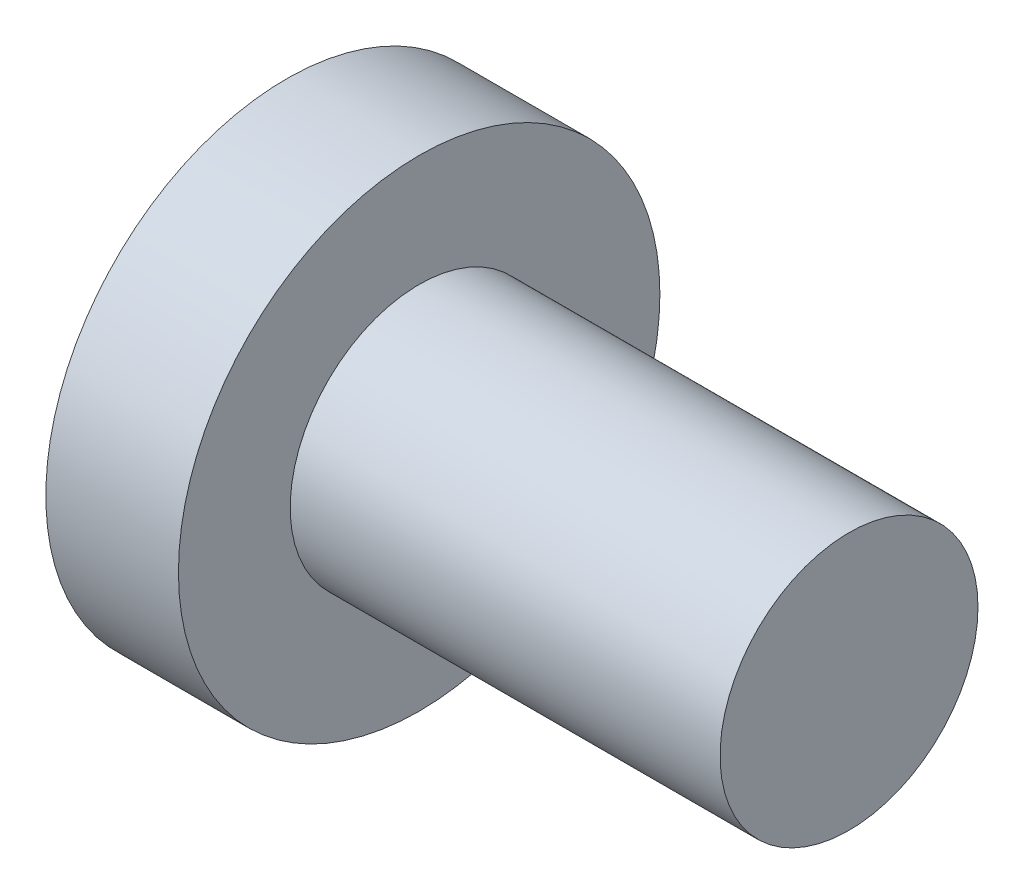
ISO-10303-21;
HEADER;
FILE_DESCRIPTION(('STEP AP214'),'2;1');
FILE_NAME('part.step','',(''),(''),'','','');
FILE_SCHEMA(('AUTOMOTIVE_DESIGN { 1 0 10303 214 1 1 1 1 }'));
ENDSEC;
DATA;
#1=APPLICATION_CONTEXT('core data for automotive mechanical design processes');
#2=APPLICATION_PROTOCOL_DEFINITION('international standard','automotive_design',2000,#1);
#3=PRODUCT_CONTEXT('',#1,'mechanical');
#4=PRODUCT('Part','Part','',(#3));
#5=PRODUCT_RELATED_PRODUCT_CATEGORY('part','',(#4));
#6=PRODUCT_DEFINITION_FORMATION('','',#4);
#7=PRODUCT_DEFINITION_CONTEXT('part definition',#1,'design');
#8=PRODUCT_DEFINITION('design','',#6,#7);
#9=PRODUCT_DEFINITION_SHAPE('','',#8);
#10=(LENGTH_UNIT() NAMED_UNIT(*) SI_UNIT(.MILLI.,.METRE.));
#11=(NAMED_UNIT(*) PLANE_ANGLE_UNIT() SI_UNIT($,.RADIAN.));
#12=(NAMED_UNIT(*) SI_UNIT($,.STERADIAN.) SOLID_ANGLE_UNIT());
#13=UNCERTAINTY_MEASURE_WITH_UNIT(LENGTH_MEASURE(1.E-05),#10,'distance_accuracy_value','');
#14=(GEOMETRIC_REPRESENTATION_CONTEXT(3) GLOBAL_UNCERTAINTY_ASSIGNED_CONTEXT((#13)) GLOBAL_UNIT_ASSIGNED_CONTEXT((#10,
#11,#12)) REPRESENTATION_CONTEXT('',''));
#15=CARTESIAN_POINT('',(0.,0.,0.));
#16=DIRECTION('',(0.,0.,1.));
#17=DIRECTION('',(1.,0.,0.));
#18=AXIS2_PLACEMENT_3D('',#15,#16,#17);
#19=CARTESIAN_POINT('',(5.,0.,0.));
#20=DIRECTION('',(1.,0.,0.));
#21=DIRECTION('',(0.,1.,0.));
#22=AXIS2_PLACEMENT_3D('',#19,#20,#21);
#23=SPHERICAL_SURFACE('',#22,5.);
#24=CARTESIAN_POINT('',(0.857536964558404,0.,0.));
#25=DIRECTION('',(1.,0.,0.));
#26=DIRECTION('',(0.,0.,-1.));
#27=AXIS2_PLACEMENT_3D('',#24,#25,#26);
#28=CIRCLE('',#27,2.8);
#29=CARTESIAN_POINT('',(0.857536964558404,0.,-2.8));
#30=VERTEX_POINT('',#29);
#31=EDGE_CURVE('E341',#30,#30,#28,.T.);
#32=ORIENTED_EDGE('',*,*,#31,.F.);
#33=EDGE_LOOP('',(#32));
#34=FACE_BOUND('',#33,.T.);
#35=CARTESIAN_POINT('',(5.,0.3,0.));
#36=DIRECTION('',(0.,-1.,0.));
#37=DIRECTION('',(0.,0.,-1.));
#38=AXIS2_PLACEMENT_3D('',#35,#36,#37);
#39=CIRCLE('',#38,4.99099188538711);
#40=CARTESIAN_POINT('',(0.204192141108152,0.3,-1.3821096123648));
#41=VERTEX_POINT('',#40);
#42=CARTESIAN_POINT('',(0.0467879563046877,0.3,-0.612935926660946));
#43=VERTEX_POINT('',#42);
#44=EDGE_CURVE('E400',#41,#43,#39,.F.);
#45=ORIENTED_EDGE('',*,*,#44,.T.);
#46=CARTESIAN_POINT('',(4.93762590329132,0.196907273785474,0.341053402576316));
#47=DIRECTION('',(0.156434465040231,-0.493844170297568,-0.855363193977087));
#48=DIRECTION('',(0.,0.866025403784439,-0.5));
#49=AXIS2_PLACEMENT_3D('',#46,#47,#48);
#50=CIRCLE('',#49,4.9840766019576);
#51=CARTESIAN_POINT('',(0.194493269927356,0.976500145219274,-0.976500145219275));
#52=VERTEX_POINT('',#51);
#53=EDGE_CURVE('E294',#43,#52,#50,.T.);
#54=ORIENTED_EDGE('',*,*,#53,.T.);
#55=CARTESIAN_POINT('',(4.93762590329132,-0.341053402576316,-0.196907273785474));
#56=DIRECTION('',(0.156434465040231,0.855363193977087,0.493844170297568));
#57=DIRECTION('',(0.,-0.5,0.866025403784439));
#58=AXIS2_PLACEMENT_3D('',#55,#56,#57);
#59=CIRCLE('',#58,4.9840766019576);
#60=CARTESIAN_POINT('',(0.0467879563046877,0.612935926660946,-0.3));
#61=VERTEX_POINT('',#60);
#62=EDGE_CURVE('E285',#52,#61,#59,.T.);
#63=ORIENTED_EDGE('',*,*,#62,.T.);
#64=CARTESIAN_POINT('',(5.,0.,-0.3));
#65=DIRECTION('',(0.,0.,1.));
#66=DIRECTION('',(1.,0.,0.));
#67=AXIS2_PLACEMENT_3D('',#64,#65,#66);
#68=CIRCLE('',#67,4.99099188538711);
#69=CARTESIAN_POINT('',(0.204192141108152,1.3821096123648,-0.3));
#70=VERTEX_POINT('',#69);
#71=EDGE_CURVE('E398',#61,#70,#68,.F.);
#72=ORIENTED_EDGE('',*,*,#71,.T.);
#73=CARTESIAN_POINT('',(4.39951905283833,-1.0400635094611,0.));
#74=DIRECTION('',(-0.500000000000001,-0.866025403784438,0.));
#75=DIRECTION('',(0.866025403784438,-0.500000000000001,0.));
#76=AXIS2_PLACEMENT_3D('',#73,#74,#75);
#77=CIRCLE('',#76,4.8536265336739);
#78=CARTESIAN_POINT('',(0.204192141108152,1.3821096123648,0.3));
#79=VERTEX_POINT('',#78);
#80=EDGE_CURVE('E401',#70,#79,#77,.F.);
#81=ORIENTED_EDGE('',*,*,#80,.T.);
#82=CARTESIAN_POINT('',(5.,0.,0.3));
#83=DIRECTION('',(0.,0.,-1.));
#84=DIRECTION('',(0.,1.,0.));
#85=AXIS2_PLACEMENT_3D('',#82,#83,#84);
#86=CIRCLE('',#85,4.99099188538711);
#87=CARTESIAN_POINT('',(0.0467879563046877,0.612935926660946,0.3));
#88=VERTEX_POINT('',#87);
#89=EDGE_CURVE('E355',#79,#88,#86,.F.);
#90=ORIENTED_EDGE('',*,*,#89,.T.);
#91=CARTESIAN_POINT('',(4.93762590329132,-0.341053402576316,0.196907273785474));
#92=DIRECTION('',(0.156434465040231,0.855363193977087,-0.493844170297568));
#93=DIRECTION('',(0.,0.5,0.866025403784439));
#94=AXIS2_PLACEMENT_3D('',#91,#92,#93);
#95=CIRCLE('',#94,4.9840766019576);
#96=CARTESIAN_POINT('',(0.194493269927356,0.976500145219275,0.976500145219275));
#97=VERTEX_POINT('',#96);
#98=EDGE_CURVE('E308',#88,#97,#95,.T.);
#99=ORIENTED_EDGE('',*,*,#98,.T.);
#100=CARTESIAN_POINT('',(4.93762590329132,0.196907273785474,-0.341053402576316));
#101=DIRECTION('',(0.156434465040231,-0.493844170297568,0.855363193977087));
#102=DIRECTION('',(0.,-0.866025403784439,-0.5));
#103=AXIS2_PLACEMENT_3D('',#100,#101,#102);
#104=CIRCLE('',#103,4.9840766019576);
#105=CARTESIAN_POINT('',(0.0467879563046886,0.3,0.612935926660946));
#106=VERTEX_POINT('',#105);
#107=EDGE_CURVE('E301',#97,#106,#104,.T.);
#108=ORIENTED_EDGE('',*,*,#107,.T.);
#109=CARTESIAN_POINT('',(5.,0.3,0.));
#110=DIRECTION('',(0.,-1.,0.));
#111=DIRECTION('',(0.,0.,-1.));
#112=AXIS2_PLACEMENT_3D('',#109,#110,#111);
#113=CIRCLE('',#112,4.99099188538711);
#114=CARTESIAN_POINT('',(0.204192141108151,0.3,1.3821096123648));
#115=VERTEX_POINT('',#114);
#116=EDGE_CURVE('E360',#106,#115,#113,.F.);
#117=ORIENTED_EDGE('',*,*,#116,.T.);
#118=CARTESIAN_POINT('',(4.39951905283832,0.,-1.0400635094611));
#119=DIRECTION('',(-0.500000000000001,0.,-0.866025403784438));
#120=DIRECTION('',(-0.866025403784438,0.,0.500000000000001));
#121=AXIS2_PLACEMENT_3D('',#118,#119,#120);
#122=CIRCLE('',#121,4.8536265336739);
#123=CARTESIAN_POINT('',(0.204192141108151,-0.3,1.3821096123648));
#124=VERTEX_POINT('',#123);
#125=EDGE_CURVE('E405',#115,#124,#122,.F.);
#126=ORIENTED_EDGE('',*,*,#125,.T.);
#127=CARTESIAN_POINT('',(5.,-0.3,0.));
#128=DIRECTION('',(0.,1.,0.));
#129=DIRECTION('',(0.,0.,1.));
#130=AXIS2_PLACEMENT_3D('',#127,#128,#129);
#131=CIRCLE('',#130,4.99099188538711);
#132=CARTESIAN_POINT('',(0.0467879563046877,-0.3,0.612935926660946));
#133=VERTEX_POINT('',#132);
#134=EDGE_CURVE('E392',#124,#133,#131,.F.);
#135=ORIENTED_EDGE('',*,*,#134,.T.);
#136=CARTESIAN_POINT('',(4.93762590329132,-0.196907273785474,-0.341053402576316));
#137=DIRECTION('',(0.156434465040231,0.493844170297568,0.855363193977087));
#138=DIRECTION('',(0.,-0.866025403784439,0.5));
#139=AXIS2_PLACEMENT_3D('',#136,#137,#138);
#140=CIRCLE('',#139,4.9840766019576);
#141=CARTESIAN_POINT('',(0.194493269927357,-0.976500145219275,0.976500145219275));
#142=VERTEX_POINT('',#141);
#143=EDGE_CURVE('E336',#133,#142,#140,.T.);
#144=ORIENTED_EDGE('',*,*,#143,.T.);
#145=CARTESIAN_POINT('',(4.93762590329132,0.341053402576316,0.196907273785474));
#146=DIRECTION('',(0.156434465040231,-0.855363193977086,-0.493844170297568));
#147=DIRECTION('',(0.,0.5,-0.866025403784439));
#148=AXIS2_PLACEMENT_3D('',#145,#146,#147);
#149=CIRCLE('',#148,4.9840766019576);
#150=CARTESIAN_POINT('',(0.0467879563046877,-0.612935926660946,0.3));
#151=VERTEX_POINT('',#150);
#152=EDGE_CURVE('E329',#142,#151,#149,.T.);
#153=ORIENTED_EDGE('',*,*,#152,.T.);
#154=CARTESIAN_POINT('',(5.,0.,0.3));
#155=DIRECTION('',(0.,0.,-1.));
#156=DIRECTION('',(0.,1.,0.));
#157=AXIS2_PLACEMENT_3D('',#154,#155,#156);
#158=CIRCLE('',#157,4.99099188538711);
#159=CARTESIAN_POINT('',(0.204192141108152,-1.3821096123648,0.299999999999999));
#160=VERTEX_POINT('',#159);
#161=EDGE_CURVE('E390',#151,#160,#158,.F.);
#162=ORIENTED_EDGE('',*,*,#161,.T.);
#163=CARTESIAN_POINT('',(4.39951905283833,1.0400635094611,0.));
#164=DIRECTION('',(-0.500000000000001,0.866025403784438,0.));
#165=DIRECTION('',(-0.866025403784438,-0.500000000000001,0.));
#166=AXIS2_PLACEMENT_3D('',#163,#164,#165);
#167=CIRCLE('',#166,4.8536265336739);
#168=CARTESIAN_POINT('',(0.204192141108152,-1.3821096123648,-0.3));
#169=VERTEX_POINT('',#168);
#170=EDGE_CURVE('E393',#160,#169,#167,.F.);
#171=ORIENTED_EDGE('',*,*,#170,.T.);
#172=CARTESIAN_POINT('',(5.,0.,-0.3));
#173=DIRECTION('',(0.,0.,1.));
#174=DIRECTION('',(1.,0.,0.));
#175=AXIS2_PLACEMENT_3D('',#172,#173,#174);
#176=CIRCLE('',#175,4.99099188538711);
#177=CARTESIAN_POINT('',(0.0467879563046886,-0.612935926660946,-0.3));
#178=VERTEX_POINT('',#177);
#179=EDGE_CURVE('E394',#169,#178,#176,.F.);
#180=ORIENTED_EDGE('',*,*,#179,.T.);
#181=CARTESIAN_POINT('',(4.93762590329132,0.341053402576316,-0.196907273785474));
#182=DIRECTION('',(0.156434465040231,-0.855363193977086,0.493844170297568));
#183=DIRECTION('',(0.,-0.5,-0.866025403784439));
#184=AXIS2_PLACEMENT_3D('',#181,#182,#183);
#185=CIRCLE('',#184,4.9840766019576);
#186=CARTESIAN_POINT('',(0.194493269927357,-0.976500145219275,-0.976500145219275));
#187=VERTEX_POINT('',#186);
#188=EDGE_CURVE('E315',#178,#187,#185,.T.);
#189=ORIENTED_EDGE('',*,*,#188,.T.);
#190=CARTESIAN_POINT('',(4.93762590329132,-0.196907273785474,0.341053402576316));
#191=DIRECTION('',(0.156434465040231,0.493844170297568,-0.855363193977087));
#192=DIRECTION('',(0.,0.866025403784439,0.5));
#193=AXIS2_PLACEMENT_3D('',#190,#191,#192);
#194=CIRCLE('',#193,4.9840766019576);
#195=CARTESIAN_POINT('',(0.0467879563046877,-0.3,-0.612935926660946));
#196=VERTEX_POINT('',#195);
#197=EDGE_CURVE('E322',#187,#196,#194,.T.);
#198=ORIENTED_EDGE('',*,*,#197,.T.);
#199=CARTESIAN_POINT('',(5.,-0.3,0.));
#200=DIRECTION('',(0.,1.,0.));
#201=DIRECTION('',(0.,0.,1.));
#202=AXIS2_PLACEMENT_3D('',#199,#200,#201);
#203=CIRCLE('',#202,4.99099188538711);
#204=CARTESIAN_POINT('',(0.204192141108152,-0.3,-1.3821096123648));
#205=VERTEX_POINT('',#204);
#206=EDGE_CURVE('E397',#196,#205,#203,.F.);
#207=ORIENTED_EDGE('',*,*,#206,.T.);
#208=CARTESIAN_POINT('',(4.39951905283833,0.,1.0400635094611));
#209=DIRECTION('',(-0.500000000000001,0.,0.866025403784438));
#210=DIRECTION('',(0.866025403784438,0.,0.500000000000001));
#211=AXIS2_PLACEMENT_3D('',#208,#209,#210);
#212=CIRCLE('',#211,4.8536265336739);
#213=EDGE_CURVE('E409',#205,#41,#212,.F.);
#214=ORIENTED_EDGE('',*,*,#213,.T.);
#215=EDGE_LOOP('',(#45,#54,#63,#72,#81,#90,#99,#108,#117,#126,#135,#144,#153,#162,#171,#180,
#189,#198,#207,#214));
#216=FACE_BOUND('',#215,.T.);
#217=ADVANCED_FACE('F36',(#34,#216),#23,.T.);
#218=CARTESIAN_POINT('',(1.68,0.3,0.3));
#219=DIRECTION('',(0.,-1.,0.));
#220=DIRECTION('',(0.,0.,-1.));
#221=AXIS2_PLACEMENT_3D('',#218,#219,#220);
#222=PLANE('',#221);
#223=ORIENTED_EDGE('',*,*,#116,.F.);
#224=DIRECTION('',(-0.983684410778463,0.,0.179902695898166));
#225=VECTOR('',#224,1.);
#226=CARTESIAN_POINT('',(1.68252060641683,0.3,0.313782346204236));
#227=LINE('',#226,#225);
#228=CARTESIAN_POINT('',(0.117519911330804,0.3,0.6));
#229=VERTEX_POINT('',#228);
#230=EDGE_CURVE('E298',#106,#229,#227,.F.);
#231=ORIENTED_EDGE('',*,*,#230,.T.);
#232=DIRECTION('',(-1.,0.,0.));
#233=VECTOR('',#232,1.);
#234=CARTESIAN_POINT('',(1.68,0.3,0.6));
#235=LINE('',#234,#233);
#236=CARTESIAN_POINT('',(1.55884572681198,0.3,0.6));
#237=VERTEX_POINT('',#236);
#238=EDGE_CURVE('E370',#229,#237,#235,.F.);
#239=ORIENTED_EDGE('',*,*,#238,.T.);
#240=DIRECTION('',(-0.866025403784438,0.,0.500000000000001));
#241=VECTOR('',#240,1.);
#242=CARTESIAN_POINT('',(0.,0.3,1.5));
#243=LINE('',#242,#241);
#244=EDGE_CURVE('E345',#237,#115,#243,.T.);
#245=ORIENTED_EDGE('',*,*,#244,.T.);
#246=EDGE_LOOP('',(#223,#231,#239,#245));
#247=FACE_BOUND('',#246,.T.);
#248=ADVANCED_FACE('F563',(#247),#222,.T.);
#249=CARTESIAN_POINT('',(1.68,-0.3,0.3));
#250=DIRECTION('',(0.,1.,0.));
#251=DIRECTION('',(0.,0.,1.));
#252=AXIS2_PLACEMENT_3D('',#249,#250,#251);
#253=PLANE('',#252);
#254=DIRECTION('',(-1.,0.,0.));
#255=VECTOR('',#254,1.);
#256=CARTESIAN_POINT('',(1.68,-0.3,0.6));
#257=LINE('',#256,#255);
#258=CARTESIAN_POINT('',(1.55884572681198,-0.3,0.6));
#259=VERTEX_POINT('',#258);
#260=CARTESIAN_POINT('',(0.117519911330806,-0.3,0.6));
#261=VERTEX_POINT('',#260);
#262=EDGE_CURVE('E356',#259,#261,#257,.T.);
#263=ORIENTED_EDGE('',*,*,#262,.T.);
#264=DIRECTION('',(0.983684410778463,0.,-0.179902695898166));
#265=VECTOR('',#264,1.);
#266=CARTESIAN_POINT('',(1.68252060641683,-0.3,0.313782346204236));
#267=LINE('',#266,#265);
#268=EDGE_CURVE('E333',#261,#133,#267,.F.);
#269=ORIENTED_EDGE('',*,*,#268,.T.);
#270=ORIENTED_EDGE('',*,*,#134,.F.);
#271=DIRECTION('',(-0.866025403784438,0.,0.500000000000001));
#272=VECTOR('',#271,1.);
#273=CARTESIAN_POINT('',(1.77961524227066,-0.3,0.472538660821069));
#274=LINE('',#273,#272);
#275=EDGE_CURVE('E415',#259,#124,#274,.T.);
#276=ORIENTED_EDGE('',*,*,#275,.F.);
#277=EDGE_LOOP('',(#263,#269,#270,#276));
#278=FACE_BOUND('',#277,.T.);
#279=ADVANCED_FACE('F570',(#278),#253,.T.);
#280=CARTESIAN_POINT('',(1.68,-0.3,0.3));
#281=DIRECTION('',(0.,0.,-1.));
#282=DIRECTION('',(0.,1.,0.));
#283=AXIS2_PLACEMENT_3D('',#280,#281,#282);
#284=PLANE('',#283);
#285=ORIENTED_EDGE('',*,*,#161,.F.);
#286=DIRECTION('',(-0.983684410778463,-0.179902695898166,0.));
#287=VECTOR('',#286,1.);
#288=CARTESIAN_POINT('',(1.68252060641683,-0.313782346204236,0.3));
#289=LINE('',#288,#287);
#290=CARTESIAN_POINT('',(0.117519911330802,-0.6,0.3));
#291=VERTEX_POINT('',#290);
#292=EDGE_CURVE('E326',#151,#291,#289,.F.);
#293=ORIENTED_EDGE('',*,*,#292,.T.);
#294=DIRECTION('',(-1.,0.,0.));
#295=VECTOR('',#294,1.);
#296=CARTESIAN_POINT('',(1.68,-0.6,0.3));
#297=LINE('',#296,#295);
#298=CARTESIAN_POINT('',(1.55884572681198,-0.6,0.3));
#299=VERTEX_POINT('',#298);
#300=EDGE_CURVE('E359',#291,#299,#297,.F.);
#301=ORIENTED_EDGE('',*,*,#300,.T.);
#302=DIRECTION('',(-0.866025403784438,-0.500000000000001,0.));
#303=VECTOR('',#302,1.);
#304=CARTESIAN_POINT('',(0.,-1.5,0.299999999999999));
#305=LINE('',#304,#303);
#306=EDGE_CURVE('E412',#299,#160,#305,.T.);
#307=ORIENTED_EDGE('',*,*,#306,.T.);
#308=EDGE_LOOP('',(#285,#293,#301,#307));
#309=FACE_BOUND('',#308,.T.);
#310=ADVANCED_FACE('F499',(#309),#284,.T.);
#311=CARTESIAN_POINT('',(1.68,-0.3,-0.3));
#312=DIRECTION('',(0.,0.,1.));
#313=DIRECTION('',(1.,0.,0.));
#314=AXIS2_PLACEMENT_3D('',#311,#312,#313);
#315=PLANE('',#314);
#316=DIRECTION('',(-1.,0.,0.));
#317=VECTOR('',#316,1.);
#318=CARTESIAN_POINT('',(1.68,-0.6,-0.3));
#319=LINE('',#318,#317);
#320=CARTESIAN_POINT('',(1.55884572681199,-0.6,-0.3));
#321=VERTEX_POINT('',#320);
#322=CARTESIAN_POINT('',(0.117519911330804,-0.6,-0.3));
#323=VERTEX_POINT('',#322);
#324=EDGE_CURVE('E362',#321,#323,#319,.T.);
#325=ORIENTED_EDGE('',*,*,#324,.T.);
#326=DIRECTION('',(0.983684410778463,0.179902695898166,0.));
#327=VECTOR('',#326,1.);
#328=CARTESIAN_POINT('',(1.68252060641683,-0.313782346204236,-0.3));
#329=LINE('',#328,#327);
#330=EDGE_CURVE('E312',#323,#178,#329,.F.);
#331=ORIENTED_EDGE('',*,*,#330,.T.);
#332=ORIENTED_EDGE('',*,*,#179,.F.);
#333=DIRECTION('',(-0.866025403784438,-0.500000000000001,0.));
#334=VECTOR('',#333,1.);
#335=CARTESIAN_POINT('',(1.77961524227066,-0.472538660821069,-0.3));
#336=LINE('',#335,#334);
#337=EDGE_CURVE('E416',#321,#169,#336,.T.);
#338=ORIENTED_EDGE('',*,*,#337,.F.);
#339=EDGE_LOOP('',(#325,#331,#332,#338));
#340=FACE_BOUND('',#339,.T.);
#341=ADVANCED_FACE('F508',(#340),#315,.T.);
#342=CARTESIAN_POINT('',(1.68,-0.3,-0.3));
#343=DIRECTION('',(0.,1.,0.));
#344=DIRECTION('',(0.,0.,1.));
#345=AXIS2_PLACEMENT_3D('',#342,#343,#344);
#346=PLANE('',#345);
#347=ORIENTED_EDGE('',*,*,#206,.F.);
#348=DIRECTION('',(-0.983684410778463,0.,-0.179902695898166));
#349=VECTOR('',#348,1.);
#350=CARTESIAN_POINT('',(1.68252060641683,-0.3,-0.313782346204236));
#351=LINE('',#350,#349);
#352=CARTESIAN_POINT('',(0.117519911330803,-0.3,-0.6));
#353=VERTEX_POINT('',#352);
#354=EDGE_CURVE('E319',#196,#353,#351,.F.);
#355=ORIENTED_EDGE('',*,*,#354,.T.);
#356=DIRECTION('',(-1.,0.,0.));
#357=VECTOR('',#356,1.);
#358=CARTESIAN_POINT('',(1.68,-0.3,-0.6));
#359=LINE('',#358,#357);
#360=CARTESIAN_POINT('',(1.55884572681198,-0.3,-0.6));
#361=VERTEX_POINT('',#360);
#362=EDGE_CURVE('E365',#353,#361,#359,.F.);
#363=ORIENTED_EDGE('',*,*,#362,.T.);
#364=DIRECTION('',(-0.866025403784438,0.,-0.500000000000001));
#365=VECTOR('',#364,1.);
#366=CARTESIAN_POINT('',(0.,-0.3,-1.5));
#367=LINE('',#366,#365);
#368=EDGE_CURVE('E421',#361,#205,#367,.T.);
#369=ORIENTED_EDGE('',*,*,#368,.T.);
#370=EDGE_LOOP('',(#347,#355,#363,#369));
#371=FACE_BOUND('',#370,.T.);
#372=ADVANCED_FACE('F522',(#371),#346,.T.);
#373=CARTESIAN_POINT('',(1.68,0.3,-0.3));
#374=DIRECTION('',(0.,-1.,0.));
#375=DIRECTION('',(0.,0.,-1.));
#376=AXIS2_PLACEMENT_3D('',#373,#374,#375);
#377=PLANE('',#376);
#378=DIRECTION('',(-1.,0.,0.));
#379=VECTOR('',#378,1.);
#380=CARTESIAN_POINT('',(1.68,0.3,-0.6));
#381=LINE('',#380,#379);
#382=CARTESIAN_POINT('',(1.55884572681198,0.3,-0.6));
#383=VERTEX_POINT('',#382);
#384=CARTESIAN_POINT('',(0.117519911330802,0.3,-0.6));
#385=VERTEX_POINT('',#384);
#386=EDGE_CURVE('E372',#383,#385,#381,.T.);
#387=ORIENTED_EDGE('',*,*,#386,.T.);
#388=DIRECTION('',(0.983684410778463,0.,0.179902695898166));
#389=VECTOR('',#388,1.);
#390=CARTESIAN_POINT('',(1.68252060641683,0.3,-0.313782346204236));
#391=LINE('',#390,#389);
#392=EDGE_CURVE('E291',#385,#43,#391,.F.);
#393=ORIENTED_EDGE('',*,*,#392,.T.);
#394=ORIENTED_EDGE('',*,*,#44,.F.);
#395=DIRECTION('',(-0.866025403784438,0.,-0.500000000000001));
#396=VECTOR('',#395,1.);
#397=CARTESIAN_POINT('',(1.77961524227066,0.3,-0.472538660821069));
#398=LINE('',#397,#396);
#399=EDGE_CURVE('E434',#383,#41,#398,.T.);
#400=ORIENTED_EDGE('',*,*,#399,.F.);
#401=EDGE_LOOP('',(#387,#393,#394,#400));
#402=FACE_BOUND('',#401,.T.);
#403=ADVANCED_FACE('F529',(#402),#377,.T.);
#404=CARTESIAN_POINT('',(1.68,0.3,-0.3));
#405=DIRECTION('',(0.,0.,1.));
#406=DIRECTION('',(1.,0.,0.));
#407=AXIS2_PLACEMENT_3D('',#404,#405,#406);
#408=PLANE('',#407);
#409=ORIENTED_EDGE('',*,*,#71,.F.);
#410=DIRECTION('',(-0.983684410778463,0.179902695898166,0.));
#411=VECTOR('',#410,1.);
#412=CARTESIAN_POINT('',(1.68252060641683,0.313782346204236,-0.3));
#413=LINE('',#412,#411);
#414=CARTESIAN_POINT('',(0.117519911330805,0.6,-0.3));
#415=VERTEX_POINT('',#414);
#416=EDGE_CURVE('E282',#61,#415,#413,.F.);
#417=ORIENTED_EDGE('',*,*,#416,.T.);
#418=DIRECTION('',(-1.,0.,0.));
#419=VECTOR('',#418,1.);
#420=CARTESIAN_POINT('',(1.68,0.6,-0.3));
#421=LINE('',#420,#419);
#422=CARTESIAN_POINT('',(1.55884572681199,0.6,-0.3));
#423=VERTEX_POINT('',#422);
#424=EDGE_CURVE('E375',#415,#423,#421,.F.);
#425=ORIENTED_EDGE('',*,*,#424,.T.);
#426=DIRECTION('',(-0.866025403784438,0.500000000000001,0.));
#427=VECTOR('',#426,1.);
#428=CARTESIAN_POINT('',(0.,1.5,-0.3));
#429=LINE('',#428,#427);
#430=EDGE_CURVE('E431',#423,#70,#429,.T.);
#431=ORIENTED_EDGE('',*,*,#430,.T.);
#432=EDGE_LOOP('',(#409,#417,#425,#431));
#433=FACE_BOUND('',#432,.T.);
#434=ADVANCED_FACE('F539',(#433),#408,.T.);
#435=CARTESIAN_POINT('',(1.68,0.3,0.3));
#436=DIRECTION('',(0.,0.,-1.));
#437=DIRECTION('',(0.,1.,0.));
#438=AXIS2_PLACEMENT_3D('',#435,#436,#437);
#439=PLANE('',#438);
#440=DIRECTION('',(-1.,0.,0.));
#441=VECTOR('',#440,1.);
#442=CARTESIAN_POINT('',(1.68,0.6,0.3));
#443=LINE('',#442,#441);
#444=CARTESIAN_POINT('',(1.55884572681199,0.6,0.3));
#445=VERTEX_POINT('',#444);
#446=CARTESIAN_POINT('',(0.117519911330804,0.6,0.3));
#447=VERTEX_POINT('',#446);
#448=EDGE_CURVE('E367',#445,#447,#443,.T.);
#449=ORIENTED_EDGE('',*,*,#448,.T.);
#450=DIRECTION('',(0.983684410778463,-0.179902695898166,0.));
#451=VECTOR('',#450,1.);
#452=CARTESIAN_POINT('',(1.68252060641683,0.313782346204236,0.3));
#453=LINE('',#452,#451);
#454=EDGE_CURVE('E305',#447,#88,#453,.F.);
#455=ORIENTED_EDGE('',*,*,#454,.T.);
#456=ORIENTED_EDGE('',*,*,#89,.F.);
#457=DIRECTION('',(-0.866025403784438,0.500000000000001,0.));
#458=VECTOR('',#457,1.);
#459=CARTESIAN_POINT('',(1.77961524227066,0.472538660821069,0.3));
#460=LINE('',#459,#458);
#461=EDGE_CURVE('E435',#445,#79,#460,.T.);
#462=ORIENTED_EDGE('',*,*,#461,.F.);
#463=EDGE_LOOP('',(#449,#455,#456,#462));
#464=FACE_BOUND('',#463,.T.);
#465=ADVANCED_FACE('F549',(#464),#439,.T.);
#466=CARTESIAN_POINT('',(1.68,0.3,0.3));
#467=DIRECTION('',(1.,0.,0.));
#468=DIRECTION('',(0.,0.,-1.));
#469=AXIS2_PLACEMENT_3D('',#466,#467,#468);
#470=PLANE('',#469);
#471=DIRECTION('',(0.,-1.,0.));
#472=VECTOR('',#471,1.);
#473=CARTESIAN_POINT('',(1.68,0.,0.530051547761425));
#474=LINE('',#473,#472);
#475=CARTESIAN_POINT('',(1.68,0.308268592658542,0.530051547761425));
#476=VERTEX_POINT('',#475);
#477=CARTESIAN_POINT('',(1.68,-0.308268592658542,0.530051547761425));
#478=VERTEX_POINT('',#477);
#479=EDGE_CURVE('E340',#476,#478,#474,.T.);
#480=ORIENTED_EDGE('',*,*,#479,.F.);
#481=CARTESIAN_POINT('',(1.68,0.6,0.6));
#482=DIRECTION('',(1.,0.,0.));
#483=DIRECTION('',(0.,0.,-1.));
#484=AXIS2_PLACEMENT_3D('',#481,#482,#483);
#485=CIRCLE('',#484,0.3);
#486=CARTESIAN_POINT('',(1.68,0.530051547761426,0.308268592658541));
#487=VERTEX_POINT('',#486);
#488=EDGE_CURVE('E383',#476,#487,#485,.T.);
#489=ORIENTED_EDGE('',*,*,#488,.T.);
#490=DIRECTION('',(0.,0.,1.));
#491=VECTOR('',#490,1.);
#492=CARTESIAN_POINT('',(1.68,0.530051547761426,0.));
#493=LINE('',#492,#491);
#494=CARTESIAN_POINT('',(1.68,0.530051547761426,-0.308268592658542));
#495=VERTEX_POINT('',#494);
#496=EDGE_CURVE('E440',#495,#487,#493,.T.);
#497=ORIENTED_EDGE('',*,*,#496,.F.);
#498=CARTESIAN_POINT('',(1.68,0.6,-0.6));
#499=DIRECTION('',(1.,0.,0.));
#500=DIRECTION('',(0.,0.,-1.));
#501=AXIS2_PLACEMENT_3D('',#498,#499,#500);
#502=CIRCLE('',#501,0.3);
#503=CARTESIAN_POINT('',(1.68,0.308268592658542,-0.530051547761426));
#504=VERTEX_POINT('',#503);
#505=EDGE_CURVE('E386',#495,#504,#502,.T.);
#506=ORIENTED_EDGE('',*,*,#505,.T.);
#507=DIRECTION('',(0.,1.,0.));
#508=VECTOR('',#507,1.);
#509=CARTESIAN_POINT('',(1.68,0.,-0.530051547761426));
#510=LINE('',#509,#508);
#511=CARTESIAN_POINT('',(1.68,-0.308268592658542,-0.530051547761426));
#512=VERTEX_POINT('',#511);
#513=EDGE_CURVE('E424',#512,#504,#510,.T.);
#514=ORIENTED_EDGE('',*,*,#513,.F.);
#515=CARTESIAN_POINT('',(1.68,-0.6,-0.6));
#516=DIRECTION('',(1.,0.,0.));
#517=DIRECTION('',(0.,0.,-1.));
#518=AXIS2_PLACEMENT_3D('',#515,#516,#517);
#519=CIRCLE('',#518,0.3);
#520=CARTESIAN_POINT('',(1.68,-0.530051547761426,-0.308268592658542));
#521=VERTEX_POINT('',#520);
#522=EDGE_CURVE('E380',#512,#521,#519,.T.);
#523=ORIENTED_EDGE('',*,*,#522,.T.);
#524=DIRECTION('',(0.,0.,-1.));
#525=VECTOR('',#524,1.);
#526=CARTESIAN_POINT('',(1.68,-0.530051547761426,0.));
#527=LINE('',#526,#525);
#528=CARTESIAN_POINT('',(1.68,-0.530051547761426,0.308268592658541));
#529=VERTEX_POINT('',#528);
#530=EDGE_CURVE('E422',#529,#521,#527,.T.);
#531=ORIENTED_EDGE('',*,*,#530,.F.);
#532=CARTESIAN_POINT('',(1.68,-0.6,0.6));
#533=DIRECTION('',(1.,0.,0.));
#534=DIRECTION('',(0.,0.,-1.));
#535=AXIS2_PLACEMENT_3D('',#532,#533,#534);
#536=CIRCLE('',#535,0.3);
#537=EDGE_CURVE('E377',#529,#478,#536,.T.);
#538=ORIENTED_EDGE('',*,*,#537,.T.);
#539=EDGE_LOOP('',(#480,#489,#497,#506,#514,#523,#531,#538));
#540=FACE_BOUND('',#539,.T.);
#541=DIRECTION('',(0.,0.866025403784439,0.5));
#542=VECTOR('',#541,1.);
#543=CARTESIAN_POINT('',(1.68,0.415975164521946,0.0991251226318298));
#544=LINE('',#543,#542);
#545=CARTESIAN_POINT('',(1.68,0.,-0.141038250581114));
#546=VERTEX_POINT('',#545);
#547=CARTESIAN_POINT('',(1.68,-0.333700083780231,-0.333700083780231));
#548=VERTEX_POINT('',#547);
#549=EDGE_CURVE('E277',#546,#548,#544,.F.);
#550=ORIENTED_EDGE('',*,*,#549,.F.);
#551=DIRECTION('',(0.,0.866025403784439,-0.5));
#552=VECTOR('',#551,1.);
#553=CARTESIAN_POINT('',(1.68,0.0340248354780544,-0.160682498503501));
#554=LINE('',#553,#552);
#555=CARTESIAN_POINT('',(1.68,0.333700083780231,-0.333700083780231));
#556=VERTEX_POINT('',#555);
#557=EDGE_CURVE('E281',#556,#546,#554,.F.);
#558=ORIENTED_EDGE('',*,*,#557,.F.);
#559=DIRECTION('',(0.,-0.5,0.866025403784439));
#560=VECTOR('',#559,1.);
#561=CARTESIAN_POINT('',(1.68,0.05087487736817,0.156167543386614));
#562=LINE('',#561,#560);
#563=CARTESIAN_POINT('',(1.68,0.141038250581114,0.));
#564=VERTEX_POINT('',#563);
#565=EDGE_CURVE('E230',#564,#556,#562,.F.);
#566=ORIENTED_EDGE('',*,*,#565,.F.);
#567=DIRECTION('',(0.,0.5,0.866025403784439));
#568=VECTOR('',#567,1.);
#569=CARTESIAN_POINT('',(1.68,0.310682498503501,0.293832456613386));
#570=LINE('',#569,#568);
#571=CARTESIAN_POINT('',(1.68,0.333700083780231,0.333700083780231));
#572=VERTEX_POINT('',#571);
#573=EDGE_CURVE('E243',#572,#564,#570,.F.);
#574=ORIENTED_EDGE('',*,*,#573,.F.);
#575=DIRECTION('',(0.,-0.866025403784439,-0.5));
#576=VECTOR('',#575,1.);
#577=CARTESIAN_POINT('',(1.68,0.293832456613386,0.310682498503501));
#578=LINE('',#577,#576);
#579=CARTESIAN_POINT('',(1.68,0.,0.141038250581114));
#580=VERTEX_POINT('',#579);
#581=EDGE_CURVE('E251',#580,#572,#578,.F.);
#582=ORIENTED_EDGE('',*,*,#581,.F.);
#583=DIRECTION('',(0.,-0.866025403784439,0.5));
#584=VECTOR('',#583,1.);
#585=CARTESIAN_POINT('',(1.68,0.156167543386615,0.0508748773681699));
#586=LINE('',#585,#584);
#587=CARTESIAN_POINT('',(1.68,-0.333700083780231,0.333700083780231));
#588=VERTEX_POINT('',#587);
#589=EDGE_CURVE('E260',#588,#580,#586,.F.);
#590=ORIENTED_EDGE('',*,*,#589,.F.);
#591=DIRECTION('',(0.,0.5,-0.866025403784439));
#592=VECTOR('',#591,1.);
#593=CARTESIAN_POINT('',(1.68,-0.160682498503501,0.0340248354780542));
#594=LINE('',#593,#592);
#595=CARTESIAN_POINT('',(1.68,-0.141038250581114,0.));
#596=VERTEX_POINT('',#595);
#597=EDGE_CURVE('E267',#596,#588,#594,.F.);
#598=ORIENTED_EDGE('',*,*,#597,.F.);
#599=DIRECTION('',(0.,-0.5,-0.866025403784439));
#600=VECTOR('',#599,1.);
#601=CARTESIAN_POINT('',(1.68,0.0991251226318298,0.415975164521946));
#602=LINE('',#601,#600);
#603=EDGE_CURVE('E271',#548,#596,#602,.F.);
#604=ORIENTED_EDGE('',*,*,#603,.F.);
#605=EDGE_LOOP('',(#550,#558,#566,#574,#582,#590,#598,#604));
#606=FACE_BOUND('',#605,.T.);
#607=ADVANCED_FACE('F609',(#540,#606),#470,.F.);
#608=CARTESIAN_POINT('',(1.68,-0.6,0.6));
#609=DIRECTION('',(-1.,0.,0.));
#610=DIRECTION('',(0.,0.,1.));
#611=AXIS2_PLACEMENT_3D('',#608,#609,#610);
#612=CYLINDRICAL_SURFACE('',#611,0.3);
#613=CARTESIAN_POINT('',(1.06458263853205,-0.6,0.6));
#614=DIRECTION('',(0.156434465040231,-0.855363193977086,-0.493844170297568));
#615=DIRECTION('',(-0.987688340595138,-0.135476220752269,-0.0782172325201156));
#616=AXIS2_PLACEMENT_3D('',#613,#614,#615);
#617=ELLIPSE('',#616,1.91773596644989,0.3);
#618=CARTESIAN_POINT('',(1.55481837994489,-0.387867965644036,0.387867965644036));
#619=VERTEX_POINT('',#618);
#620=EDGE_CURVE('E44',#291,#619,#617,.T.);
#621=ORIENTED_EDGE('',*,*,#620,.T.);
#622=CARTESIAN_POINT('',(1.06458263853206,-0.6,0.6));
#623=DIRECTION('',(0.156434465040231,0.493844170297568,0.855363193977087));
#624=DIRECTION('',(-0.987688340595138,0.0782172325201156,0.135476220752269));
#625=AXIS2_PLACEMENT_3D('',#622,#623,#624);
#626=ELLIPSE('',#625,1.91773596644989,0.3);
#627=EDGE_CURVE('E11',#619,#261,#626,.T.);
#628=ORIENTED_EDGE('',*,*,#627,.T.);
#629=ORIENTED_EDGE('',*,*,#262,.F.);
#630=CARTESIAN_POINT('',(1.55884572681198,-0.6,0.6));
#631=DIRECTION('',(-0.500000000000001,0.,-0.866025403784438));
#632=DIRECTION('',(-0.866025403784438,0.,0.500000000000001));
#633=AXIS2_PLACEMENT_3D('',#630,#631,#632);
#634=ELLIPSE('',#633,0.599999999999999,0.3);
#635=EDGE_CURVE('E447',#259,#478,#634,.T.);
#636=ORIENTED_EDGE('',*,*,#635,.T.);
#637=ORIENTED_EDGE('',*,*,#537,.F.);
#638=CARTESIAN_POINT('',(1.55884572681199,-0.6,0.6));
#639=DIRECTION('',(-0.500000000000001,0.866025403784438,0.));
#640=DIRECTION('',(-0.866025403784438,-0.500000000000001,0.));
#641=AXIS2_PLACEMENT_3D('',#638,#639,#640);
#642=ELLIPSE('',#641,0.599999999999999,0.3);
#643=EDGE_CURVE('E427',#299,#529,#642,.F.);
#644=ORIENTED_EDGE('',*,*,#643,.F.);
#645=ORIENTED_EDGE('',*,*,#300,.F.);
#646=EDGE_LOOP('',(#621,#628,#629,#636,#637,#644,#645));
#647=FACE_BOUND('',#646,.T.);
#648=ADVANCED_FACE('F493',(#647),#612,.T.);
#649=CARTESIAN_POINT('',(1.68,-0.6,-0.6));
#650=DIRECTION('',(-1.,0.,0.));
#651=DIRECTION('',(0.,0.,1.));
#652=AXIS2_PLACEMENT_3D('',#649,#650,#651);
#653=CYLINDRICAL_SURFACE('',#652,0.3);
#654=ORIENTED_EDGE('',*,*,#362,.F.);
#655=CARTESIAN_POINT('',(1.06458263853206,-0.6,-0.6));
#656=DIRECTION('',(0.156434465040231,0.493844170297568,-0.855363193977087));
#657=DIRECTION('',(-0.987688340595138,0.0782172325201156,-0.135476220752269));
#658=AXIS2_PLACEMENT_3D('',#655,#656,#657);
#659=ELLIPSE('',#658,1.91773596644989,0.3);
#660=CARTESIAN_POINT('',(1.55481837994489,-0.387867965644036,-0.387867965644036));
#661=VERTEX_POINT('',#660);
#662=EDGE_CURVE('E488',#353,#661,#659,.T.);
#663=ORIENTED_EDGE('',*,*,#662,.T.);
#664=CARTESIAN_POINT('',(1.06458263853206,-0.6,-0.6));
#665=DIRECTION('',(0.156434465040231,-0.855363193977086,0.493844170297568));
#666=DIRECTION('',(-0.987688340595138,-0.135476220752269,0.0782172325201156));
#667=AXIS2_PLACEMENT_3D('',#664,#665,#666);
#668=ELLIPSE('',#667,1.91773596644989,0.3);
#669=EDGE_CURVE('E485',#661,#323,#668,.T.);
#670=ORIENTED_EDGE('',*,*,#669,.T.);
#671=ORIENTED_EDGE('',*,*,#324,.F.);
#672=CARTESIAN_POINT('',(1.55884572681199,-0.6,-0.6));
#673=DIRECTION('',(-0.500000000000001,0.866025403784438,0.));
#674=DIRECTION('',(-0.866025403784438,-0.500000000000001,0.));
#675=AXIS2_PLACEMENT_3D('',#672,#673,#674);
#676=ELLIPSE('',#675,0.599999999999999,0.3);
#677=EDGE_CURVE('E389',#321,#521,#676,.T.);
#678=ORIENTED_EDGE('',*,*,#677,.T.);
#679=ORIENTED_EDGE('',*,*,#522,.F.);
#680=CARTESIAN_POINT('',(1.55884572681198,-0.6,-0.6));
#681=DIRECTION('',(-0.500000000000001,0.,0.866025403784438));
#682=DIRECTION('',(-0.866025403784438,0.,-0.500000000000001));
#683=AXIS2_PLACEMENT_3D('',#680,#681,#682);
#684=ELLIPSE('',#683,0.599999999999999,0.3);
#685=EDGE_CURVE('E470',#361,#512,#684,.F.);
#686=ORIENTED_EDGE('',*,*,#685,.F.);
#687=EDGE_LOOP('',(#654,#663,#670,#671,#678,#679,#686));
#688=FACE_BOUND('',#687,.T.);
#689=ADVANCED_FACE('F518',(#688),#653,.T.);
#690=CARTESIAN_POINT('',(1.68,0.6,0.6));
#691=DIRECTION('',(-1.,0.,0.));
#692=DIRECTION('',(0.,0.,1.));
#693=AXIS2_PLACEMENT_3D('',#690,#691,#692);
#694=CYLINDRICAL_SURFACE('',#693,0.3);
#695=CARTESIAN_POINT('',(1.06458263853206,0.6,0.6));
#696=DIRECTION('',(0.156434465040231,-0.493844170297568,0.855363193977087));
#697=DIRECTION('',(-0.987688340595138,-0.0782172325201156,0.135476220752269));
#698=AXIS2_PLACEMENT_3D('',#695,#696,#697);
#699=ELLIPSE('',#698,1.91773596644989,0.3);
#700=CARTESIAN_POINT('',(1.55481837994489,0.387867965644036,0.387867965644036));
#701=VERTEX_POINT('',#700);
#702=EDGE_CURVE('E479',#229,#701,#699,.T.);
#703=ORIENTED_EDGE('',*,*,#702,.T.);
#704=CARTESIAN_POINT('',(1.06458263853206,0.6,0.6));
#705=DIRECTION('',(0.156434465040231,0.855363193977087,-0.493844170297568));
#706=DIRECTION('',(-0.987688340595138,0.135476220752269,-0.0782172325201156));
#707=AXIS2_PLACEMENT_3D('',#704,#705,#706);
#708=ELLIPSE('',#707,1.91773596644989,0.3);
#709=EDGE_CURVE('E482',#701,#447,#708,.T.);
#710=ORIENTED_EDGE('',*,*,#709,.T.);
#711=ORIENTED_EDGE('',*,*,#448,.F.);
#712=CARTESIAN_POINT('',(1.55884572681199,0.6,0.6));
#713=DIRECTION('',(-0.500000000000001,-0.866025403784438,0.));
#714=DIRECTION('',(-0.866025403784438,0.500000000000001,0.));
#715=AXIS2_PLACEMENT_3D('',#712,#713,#714);
#716=ELLIPSE('',#715,0.599999999999999,0.3);
#717=EDGE_CURVE('E430',#445,#487,#716,.T.);
#718=ORIENTED_EDGE('',*,*,#717,.T.);
#719=ORIENTED_EDGE('',*,*,#488,.F.);
#720=CARTESIAN_POINT('',(1.55884572681198,0.6,0.6));
#721=DIRECTION('',(-0.500000000000001,0.,-0.866025403784438));
#722=DIRECTION('',(-0.866025403784438,0.,0.500000000000001));
#723=AXIS2_PLACEMENT_3D('',#720,#721,#722);
#724=ELLIPSE('',#723,0.599999999999999,0.3);
#725=EDGE_CURVE('E457',#237,#476,#724,.F.);
#726=ORIENTED_EDGE('',*,*,#725,.F.);
#727=ORIENTED_EDGE('',*,*,#238,.F.);
#728=EDGE_LOOP('',(#703,#710,#711,#718,#719,#726,#727));
#729=FACE_BOUND('',#728,.T.);
#730=ADVANCED_FACE('F556',(#729),#694,.T.);
#731=CARTESIAN_POINT('',(1.68,0.6,-0.6));
#732=DIRECTION('',(-1.,0.,0.));
#733=DIRECTION('',(0.,0.,1.));
#734=AXIS2_PLACEMENT_3D('',#731,#732,#733);
#735=CYLINDRICAL_SURFACE('',#734,0.3);
#736=CARTESIAN_POINT('',(1.06458263853206,0.6,-0.6));
#737=DIRECTION('',(0.156434465040231,0.855363193977087,0.493844170297568));
#738=DIRECTION('',(-0.987688340595138,0.135476220752269,0.0782172325201156));
#739=AXIS2_PLACEMENT_3D('',#736,#737,#738);
#740=ELLIPSE('',#739,1.91773596644989,0.3);
#741=CARTESIAN_POINT('',(1.55481837994489,0.387867965644036,-0.387867965644036));
#742=VERTEX_POINT('',#741);
#743=EDGE_CURVE('E473',#415,#742,#740,.T.);
#744=ORIENTED_EDGE('',*,*,#743,.T.);
#745=CARTESIAN_POINT('',(1.06458263853206,0.6,-0.6));
#746=DIRECTION('',(0.156434465040231,-0.493844170297568,-0.855363193977087));
#747=DIRECTION('',(-0.987688340595138,-0.0782172325201156,-0.135476220752269));
#748=AXIS2_PLACEMENT_3D('',#745,#746,#747);
#749=ELLIPSE('',#748,1.91773596644989,0.3);
#750=EDGE_CURVE('E476',#742,#385,#749,.T.);
#751=ORIENTED_EDGE('',*,*,#750,.T.);
#752=ORIENTED_EDGE('',*,*,#386,.F.);
#753=CARTESIAN_POINT('',(1.55884572681198,0.6,-0.6));
#754=DIRECTION('',(-0.500000000000001,0.,0.866025403784438));
#755=DIRECTION('',(-0.866025403784438,0.,-0.500000000000001));
#756=AXIS2_PLACEMENT_3D('',#753,#754,#755);
#757=ELLIPSE('',#756,0.599999999999999,0.3);
#758=EDGE_CURVE('E460',#383,#504,#757,.T.);
#759=ORIENTED_EDGE('',*,*,#758,.T.);
#760=ORIENTED_EDGE('',*,*,#505,.F.);
#761=CARTESIAN_POINT('',(1.55884572681199,0.6,-0.6));
#762=DIRECTION('',(-0.500000000000001,-0.866025403784438,0.));
#763=DIRECTION('',(-0.866025403784438,0.500000000000001,0.));
#764=AXIS2_PLACEMENT_3D('',#761,#762,#763);
#765=ELLIPSE('',#764,0.599999999999999,0.3);
#766=EDGE_CURVE('E444',#423,#495,#765,.F.);
#767=ORIENTED_EDGE('',*,*,#766,.F.);
#768=ORIENTED_EDGE('',*,*,#424,.F.);
#769=EDGE_LOOP('',(#744,#751,#752,#759,#760,#767,#768));
#770=FACE_BOUND('',#769,.T.);
#771=ADVANCED_FACE('F542',(#770),#735,.T.);
#772=CARTESIAN_POINT('',(7.4,1.5,0.));
#773=DIRECTION('',(1.,0.,0.));
#774=DIRECTION('',(0.,0.,-1.));
#775=AXIS2_PLACEMENT_3D('',#772,#773,#774);
#776=PLANE('',#775);
#777=CARTESIAN_POINT('',(7.4,0.,0.));
#778=DIRECTION('',(1.,0.,0.));
#779=DIRECTION('',(0.,0.,-1.));
#780=AXIS2_PLACEMENT_3D('',#777,#778,#779);
#781=CIRCLE('',#780,1.5);
#782=CARTESIAN_POINT('',(7.4,0.,-1.5));
#783=VERTEX_POINT('',#782);
#784=EDGE_CURVE('E352',#783,#783,#781,.T.);
#785=ORIENTED_EDGE('',*,*,#784,.T.);
#786=EDGE_LOOP('',(#785));
#787=FACE_BOUND('',#786,.T.);
#788=ADVANCED_FACE('F602',(#787),#776,.T.);
#789=CARTESIAN_POINT('',(4.51581291088132,0.,0.));
#790=DIRECTION('',(1.,0.,0.));
#791=DIRECTION('',(0.,0.,-1.));
#792=AXIS2_PLACEMENT_3D('',#789,#790,#791);
#793=CYLINDRICAL_SURFACE('',#792,1.5);
#794=CARTESIAN_POINT('',(2.4,0.,0.));
#795=DIRECTION('',(1.,0.,0.));
#796=DIRECTION('',(0.,0.,-1.));
#797=AXIS2_PLACEMENT_3D('',#794,#795,#796);
#798=CIRCLE('',#797,1.5);
#799=CARTESIAN_POINT('',(2.4,0.,-1.5));
#800=VERTEX_POINT('',#799);
#801=EDGE_CURVE('E349',#800,#800,#798,.T.);
#802=ORIENTED_EDGE('',*,*,#801,.T.);
#803=EDGE_LOOP('',(#802));
#804=FACE_BOUND('',#803,.T.);
#805=ORIENTED_EDGE('',*,*,#784,.F.);
#806=EDGE_LOOP('',(#805));
#807=FACE_BOUND('',#806,.T.);
#808=ADVANCED_FACE('F598',(#804,#807),#793,.T.);
#809=CARTESIAN_POINT('',(2.4,1.8,0.));
#810=DIRECTION('',(1.,0.,0.));
#811=DIRECTION('',(0.,0.,-1.));
#812=AXIS2_PLACEMENT_3D('',#809,#810,#811);
#813=PLANE('',#812);
#814=CARTESIAN_POINT('',(2.4,0.,0.));
#815=DIRECTION('',(1.,0.,0.));
#816=DIRECTION('',(0.,0.,-1.));
#817=AXIS2_PLACEMENT_3D('',#814,#815,#816);
#818=CIRCLE('',#817,2.8);
#819=CARTESIAN_POINT('',(2.4,0.,-2.8));
#820=VERTEX_POINT('',#819);
#821=EDGE_CURVE('E344',#820,#820,#818,.T.);
#822=ORIENTED_EDGE('',*,*,#821,.T.);
#823=EDGE_LOOP('',(#822));
#824=FACE_BOUND('',#823,.T.);
#825=ORIENTED_EDGE('',*,*,#801,.F.);
#826=EDGE_LOOP('',(#825));
#827=FACE_BOUND('',#826,.T.);
#828=ADVANCED_FACE('F594',(#824,#827),#813,.T.);
#829=CARTESIAN_POINT('',(4.51581291088132,0.,0.));
#830=DIRECTION('',(1.,0.,0.));
#831=DIRECTION('',(0.,0.,-1.));
#832=AXIS2_PLACEMENT_3D('',#829,#830,#831);
#833=CYLINDRICAL_SURFACE('',#832,2.8);
#834=ORIENTED_EDGE('',*,*,#31,.T.);
#835=EDGE_LOOP('',(#834));
#836=FACE_BOUND('',#835,.T.);
#837=ORIENTED_EDGE('',*,*,#821,.F.);
#838=EDGE_LOOP('',(#837));
#839=FACE_BOUND('',#838,.T.);
#840=ADVANCED_FACE('F591',(#836,#839),#833,.T.);
#841=CARTESIAN_POINT('',(0.,0.,1.5));
#842=DIRECTION('',(-0.500000000000001,0.,-0.866025403784438));
#843=DIRECTION('',(-0.866025403784438,0.,0.500000000000001));
#844=AXIS2_PLACEMENT_3D('',#841,#842,#843);
#845=PLANE('',#844);
#846=ORIENTED_EDGE('',*,*,#244,.F.);
#847=ORIENTED_EDGE('',*,*,#725,.T.);
#848=ORIENTED_EDGE('',*,*,#479,.T.);
#849=ORIENTED_EDGE('',*,*,#635,.F.);
#850=ORIENTED_EDGE('',*,*,#275,.T.);
#851=ORIENTED_EDGE('',*,*,#125,.F.);
#852=EDGE_LOOP('',(#846,#847,#848,#849,#850,#851));
#853=FACE_BOUND('',#852,.T.);
#854=ADVANCED_FACE('F567',(#853),#845,.T.);
#855=CARTESIAN_POINT('',(0.,-1.5,0.));
#856=DIRECTION('',(-0.500000000000001,0.866025403784438,0.));
#857=DIRECTION('',(-0.866025403784438,-0.500000000000001,0.));
#858=AXIS2_PLACEMENT_3D('',#855,#856,#857);
#859=PLANE('',#858);
#860=ORIENTED_EDGE('',*,*,#306,.F.);
#861=ORIENTED_EDGE('',*,*,#643,.T.);
#862=ORIENTED_EDGE('',*,*,#530,.T.);
#863=ORIENTED_EDGE('',*,*,#677,.F.);
#864=ORIENTED_EDGE('',*,*,#337,.T.);
#865=ORIENTED_EDGE('',*,*,#170,.F.);
#866=EDGE_LOOP('',(#860,#861,#862,#863,#864,#865));
#867=FACE_BOUND('',#866,.T.);
#868=ADVANCED_FACE('F504',(#867),#859,.T.);
#869=CARTESIAN_POINT('',(0.,0.,-1.5));
#870=DIRECTION('',(-0.500000000000001,0.,0.866025403784438));
#871=DIRECTION('',(0.866025403784438,0.,0.500000000000001));
#872=AXIS2_PLACEMENT_3D('',#869,#870,#871);
#873=PLANE('',#872);
#874=ORIENTED_EDGE('',*,*,#368,.F.);
#875=ORIENTED_EDGE('',*,*,#685,.T.);
#876=ORIENTED_EDGE('',*,*,#513,.T.);
#877=ORIENTED_EDGE('',*,*,#758,.F.);
#878=ORIENTED_EDGE('',*,*,#399,.T.);
#879=ORIENTED_EDGE('',*,*,#213,.F.);
#880=EDGE_LOOP('',(#874,#875,#876,#877,#878,#879));
#881=FACE_BOUND('',#880,.T.);
#882=ADVANCED_FACE('F525',(#881),#873,.T.);
#883=CARTESIAN_POINT('',(0.,1.5,0.));
#884=DIRECTION('',(-0.500000000000001,-0.866025403784438,0.));
#885=DIRECTION('',(0.866025403784438,-0.500000000000001,0.));
#886=AXIS2_PLACEMENT_3D('',#883,#884,#885);
#887=PLANE('',#886);
#888=ORIENTED_EDGE('',*,*,#430,.F.);
#889=ORIENTED_EDGE('',*,*,#766,.T.);
#890=ORIENTED_EDGE('',*,*,#496,.T.);
#891=ORIENTED_EDGE('',*,*,#717,.F.);
#892=ORIENTED_EDGE('',*,*,#461,.T.);
#893=ORIENTED_EDGE('',*,*,#80,.F.);
#894=EDGE_LOOP('',(#888,#889,#890,#891,#892,#893));
#895=FACE_BOUND('',#894,.T.);
#896=ADVANCED_FACE('F38',(#895),#887,.T.);
#897=CARTESIAN_POINT('',(0.,0.448287736084028,0.));
#898=DIRECTION('',(0.156434465040231,0.855363193977087,0.493844170297568));
#899=DIRECTION('',(0.,-0.5,0.866025403784439));
#900=AXIS2_PLACEMENT_3D('',#897,#898,#899);
#901=PLANE('',#900);
#902=DIRECTION('',(-0.852963114470752,0.369089369497656,-0.369089369497656));
#903=VECTOR('',#902,1.);
#904=CARTESIAN_POINT('',(0.526703486595757,0.832748021205213,-0.832748021205213));
#905=LINE('',#904,#903);
#906=EDGE_CURVE('E235',#742,#52,#905,.T.);
#907=ORIENTED_EDGE('',*,*,#906,.F.);
#908=ORIENTED_EDGE('',*,*,#743,.F.);
#909=ORIENTED_EDGE('',*,*,#416,.F.);
#910=ORIENTED_EDGE('',*,*,#62,.F.);
#911=EDGE_LOOP('',(#907,#908,#909,#910));
#912=FACE_BOUND('',#911,.T.);
#913=ADVANCED_FACE('F536',(#912),#901,.F.);
#914=CARTESIAN_POINT('',(0.,0.,-0.448287736084028));
#915=DIRECTION('',(0.156434465040231,-0.493844170297568,-0.855363193977087));
#916=DIRECTION('',(0.,0.866025403784439,-0.5));
#917=AXIS2_PLACEMENT_3D('',#914,#915,#916);
#918=PLANE('',#917);
#919=ORIENTED_EDGE('',*,*,#392,.F.);
#920=ORIENTED_EDGE('',*,*,#750,.F.);
#921=ORIENTED_EDGE('',*,*,#906,.T.);
#922=ORIENTED_EDGE('',*,*,#53,.F.);
#923=EDGE_LOOP('',(#919,#920,#921,#922));
#924=FACE_BOUND('',#923,.T.);
#925=ADVANCED_FACE('F533',(#924),#918,.F.);
#926=CARTESIAN_POINT('',(0.,0.,0.448287736084028));
#927=DIRECTION('',(0.156434465040231,-0.493844170297568,0.855363193977087));
#928=DIRECTION('',(0.,-0.866025403784439,-0.5));
#929=AXIS2_PLACEMENT_3D('',#926,#927,#928);
#930=PLANE('',#929);
#931=DIRECTION('',(-0.852963114470752,0.369089369497656,0.369089369497656));
#932=VECTOR('',#931,1.);
#933=CARTESIAN_POINT('',(0.526703486595757,0.832748021205213,0.832748021205213));
#934=LINE('',#933,#932);
#935=EDGE_CURVE('E252',#701,#97,#934,.T.);
#936=ORIENTED_EDGE('',*,*,#935,.F.);
#937=ORIENTED_EDGE('',*,*,#702,.F.);
#938=ORIENTED_EDGE('',*,*,#230,.F.);
#939=ORIENTED_EDGE('',*,*,#107,.F.);
#940=EDGE_LOOP('',(#936,#937,#938,#939));
#941=FACE_BOUND('',#940,.T.);
#942=ADVANCED_FACE('F560',(#941),#930,.F.);
#943=CARTESIAN_POINT('',(0.,0.448287736084028,0.));
#944=DIRECTION('',(0.156434465040231,0.855363193977087,-0.493844170297568));
#945=DIRECTION('',(0.,0.5,0.866025403784439));
#946=AXIS2_PLACEMENT_3D('',#943,#944,#945);
#947=PLANE('',#946);
#948=ORIENTED_EDGE('',*,*,#454,.F.);
#949=ORIENTED_EDGE('',*,*,#709,.F.);
#950=ORIENTED_EDGE('',*,*,#935,.T.);
#951=ORIENTED_EDGE('',*,*,#98,.F.);
#952=EDGE_LOOP('',(#948,#949,#950,#951));
#953=FACE_BOUND('',#952,.T.);
#954=ADVANCED_FACE('F553',(#953),#947,.F.);
#955=CARTESIAN_POINT('',(0.,-0.448287736084027,0.));
#956=DIRECTION('',(0.156434465040231,-0.855363193977086,0.493844170297568));
#957=DIRECTION('',(0.,-0.5,-0.866025403784439));
#958=AXIS2_PLACEMENT_3D('',#955,#956,#957);
#959=PLANE('',#958);
#960=ORIENTED_EDGE('',*,*,#330,.F.);
#961=ORIENTED_EDGE('',*,*,#669,.F.);
#962=DIRECTION('',(-0.852963114470752,-0.369089369497656,-0.369089369497656));
#963=VECTOR('',#962,1.);
#964=CARTESIAN_POINT('',(0.526703486595757,-0.832748021205213,-0.832748021205213));
#965=LINE('',#964,#963);
#966=EDGE_CURVE('E278',#661,#187,#965,.T.);
#967=ORIENTED_EDGE('',*,*,#966,.T.);
#968=ORIENTED_EDGE('',*,*,#188,.F.);
#969=EDGE_LOOP('',(#960,#961,#967,#968));
#970=FACE_BOUND('',#969,.T.);
#971=ADVANCED_FACE('F512',(#970),#959,.F.);
#972=CARTESIAN_POINT('',(0.,0.,-0.448287736084028));
#973=DIRECTION('',(0.156434465040231,0.493844170297568,-0.855363193977087));
#974=DIRECTION('',(0.,0.866025403784439,0.5));
#975=AXIS2_PLACEMENT_3D('',#972,#973,#974);
#976=PLANE('',#975);
#977=ORIENTED_EDGE('',*,*,#966,.F.);
#978=ORIENTED_EDGE('',*,*,#662,.F.);
#979=ORIENTED_EDGE('',*,*,#354,.F.);
#980=ORIENTED_EDGE('',*,*,#197,.F.);
#981=EDGE_LOOP('',(#977,#978,#979,#980));
#982=FACE_BOUND('',#981,.T.);
#983=ADVANCED_FACE('F515',(#982),#976,.F.);
#984=CARTESIAN_POINT('',(0.,-0.448287736084027,0.));
#985=DIRECTION('',(0.156434465040231,-0.855363193977086,-0.493844170297568));
#986=DIRECTION('',(0.,0.5,-0.866025403784439));
#987=AXIS2_PLACEMENT_3D('',#984,#985,#986);
#988=PLANE('',#987);
#989=DIRECTION('',(-0.852963114470752,-0.369089369497656,0.369089369497656));
#990=VECTOR('',#989,1.);
#991=CARTESIAN_POINT('',(0.526703486595756,-0.832748021205213,0.832748021205213));
#992=LINE('',#991,#990);
#993=EDGE_CURVE('E59',#619,#142,#992,.T.);
#994=ORIENTED_EDGE('',*,*,#993,.F.);
#995=ORIENTED_EDGE('',*,*,#620,.F.);
#996=ORIENTED_EDGE('',*,*,#292,.F.);
#997=ORIENTED_EDGE('',*,*,#152,.F.);
#998=EDGE_LOOP('',(#994,#995,#996,#997));
#999=FACE_BOUND('',#998,.T.);
#1000=ADVANCED_FACE('F496',(#999),#988,.F.);
#1001=CARTESIAN_POINT('',(0.,0.,0.448287736084028));
#1002=DIRECTION('',(0.156434465040231,0.493844170297568,0.855363193977087));
#1003=DIRECTION('',(0.,-0.866025403784439,0.5));
#1004=AXIS2_PLACEMENT_3D('',#1001,#1002,#1003);
#1005=PLANE('',#1004);
#1006=ORIENTED_EDGE('',*,*,#268,.F.);
#1007=ORIENTED_EDGE('',*,*,#627,.F.);
#1008=ORIENTED_EDGE('',*,*,#993,.T.);
#1009=ORIENTED_EDGE('',*,*,#143,.F.);
#1010=EDGE_LOOP('',(#1006,#1007,#1008,#1009));
#1011=FACE_BOUND('',#1010,.T.);
#1012=ADVANCED_FACE('F572',(#1011),#1005,.F.);
#1013=ORIENTED_EDGE('',*,*,#589,.T.);
#1014=DIRECTION('',(-0.983684410778463,0.,0.179902695898166));
#1015=VECTOR('',#1014,1.);
#1016=CARTESIAN_POINT('',(0.,0.,0.448287736084028));
#1017=LINE('',#1016,#1015);
#1018=CARTESIAN_POINT('',(2.45117870706418,0.,0.));
#1019=VERTEX_POINT('',#1018);
#1020=EDGE_CURVE('E249',#1019,#580,#1017,.T.);
#1021=ORIENTED_EDGE('',*,*,#1020,.F.);
#1022=EDGE_CURVE('E258',#1019,#588,#992,.T.);
#1023=ORIENTED_EDGE('',*,*,#1022,.T.);
#1024=EDGE_LOOP('',(#1013,#1021,#1023));
#1025=FACE_BOUND('',#1024,.T.);
#1026=ADVANCED_FACE('F257',(#1025),#1005,.F.);
#1027=ORIENTED_EDGE('',*,*,#597,.T.);
#1028=ORIENTED_EDGE('',*,*,#1022,.F.);
#1029=DIRECTION('',(-0.983684410778463,-0.179902695898166,0.));
#1030=VECTOR('',#1029,1.);
#1031=CARTESIAN_POINT('',(0.,-0.448287736084027,0.));
#1032=LINE('',#1031,#1030);
#1033=EDGE_CURVE('E265',#1019,#596,#1032,.T.);
#1034=ORIENTED_EDGE('',*,*,#1033,.T.);
#1035=EDGE_LOOP('',(#1027,#1028,#1034));
#1036=FACE_BOUND('',#1035,.T.);
#1037=ADVANCED_FACE('F264',(#1036),#988,.F.);
#1038=ORIENTED_EDGE('',*,*,#549,.T.);
#1039=EDGE_CURVE('E51',#1019,#548,#965,.T.);
#1040=ORIENTED_EDGE('',*,*,#1039,.F.);
#1041=DIRECTION('',(-0.983684410778463,0.,-0.179902695898166));
#1042=VECTOR('',#1041,1.);
#1043=CARTESIAN_POINT('',(0.,0.,-0.448287736084028));
#1044=LINE('',#1043,#1042);
#1045=EDGE_CURVE('E234',#1019,#546,#1044,.T.);
#1046=ORIENTED_EDGE('',*,*,#1045,.T.);
#1047=EDGE_LOOP('',(#1038,#1040,#1046));
#1048=FACE_BOUND('',#1047,.T.);
#1049=ADVANCED_FACE('F275',(#1048),#976,.F.);
#1050=ORIENTED_EDGE('',*,*,#603,.T.);
#1051=ORIENTED_EDGE('',*,*,#1033,.F.);
#1052=ORIENTED_EDGE('',*,*,#1039,.T.);
#1053=EDGE_LOOP('',(#1050,#1051,#1052));
#1054=FACE_BOUND('',#1053,.T.);
#1055=ADVANCED_FACE('F269',(#1054),#959,.F.);
#1056=ORIENTED_EDGE('',*,*,#573,.T.);
#1057=DIRECTION('',(-0.983684410778463,0.179902695898166,0.));
#1058=VECTOR('',#1057,1.);
#1059=CARTESIAN_POINT('',(0.,0.448287736084028,0.));
#1060=LINE('',#1059,#1058);
#1061=EDGE_CURVE('E228',#1019,#564,#1060,.T.);
#1062=ORIENTED_EDGE('',*,*,#1061,.F.);
#1063=EDGE_CURVE('E241',#1019,#572,#934,.T.);
#1064=ORIENTED_EDGE('',*,*,#1063,.T.);
#1065=EDGE_LOOP('',(#1056,#1062,#1064));
#1066=FACE_BOUND('',#1065,.T.);
#1067=ADVANCED_FACE('F240',(#1066),#947,.F.);
#1068=ORIENTED_EDGE('',*,*,#581,.T.);
#1069=ORIENTED_EDGE('',*,*,#1063,.F.);
#1070=ORIENTED_EDGE('',*,*,#1020,.T.);
#1071=EDGE_LOOP('',(#1068,#1069,#1070));
#1072=FACE_BOUND('',#1071,.T.);
#1073=ADVANCED_FACE('F248',(#1072),#930,.F.);
#1074=ORIENTED_EDGE('',*,*,#557,.T.);
#1075=ORIENTED_EDGE('',*,*,#1045,.F.);
#1076=EDGE_CURVE('E225',#1019,#556,#905,.T.);
#1077=ORIENTED_EDGE('',*,*,#1076,.T.);
#1078=EDGE_LOOP('',(#1074,#1075,#1077));
#1079=FACE_BOUND('',#1078,.T.);
#1080=ADVANCED_FACE('F280',(#1079),#918,.F.);
#1081=ORIENTED_EDGE('',*,*,#565,.T.);
#1082=ORIENTED_EDGE('',*,*,#1076,.F.);
#1083=ORIENTED_EDGE('',*,*,#1061,.T.);
#1084=EDGE_LOOP('',(#1081,#1082,#1083));
#1085=FACE_BOUND('',#1084,.T.);
#1086=ADVANCED_FACE('F227',(#1085),#901,.F.);
#1087=CLOSED_SHELL('',(#217,#248,#279,#310,#341,#372,#403,#434,#465,#607,#648,#689,#730,#771,
#788,#808,#828,#840,#854,#868,#882,#896,#913,#925,#942,#954,#971,#983,#1000,#1012,#1026,#1037,
#1049,#1055,#1067,#1073,#1080,#1086));
#1088=MANIFOLD_SOLID_BREP('B2',#1087);
#1089=ADVANCED_BREP_SHAPE_REPRESENTATION('',(#18,#1088),#14);
#1090=SHAPE_DEFINITION_REPRESENTATION(#9,#1089);
ENDSEC;
END-ISO-10303-21;
